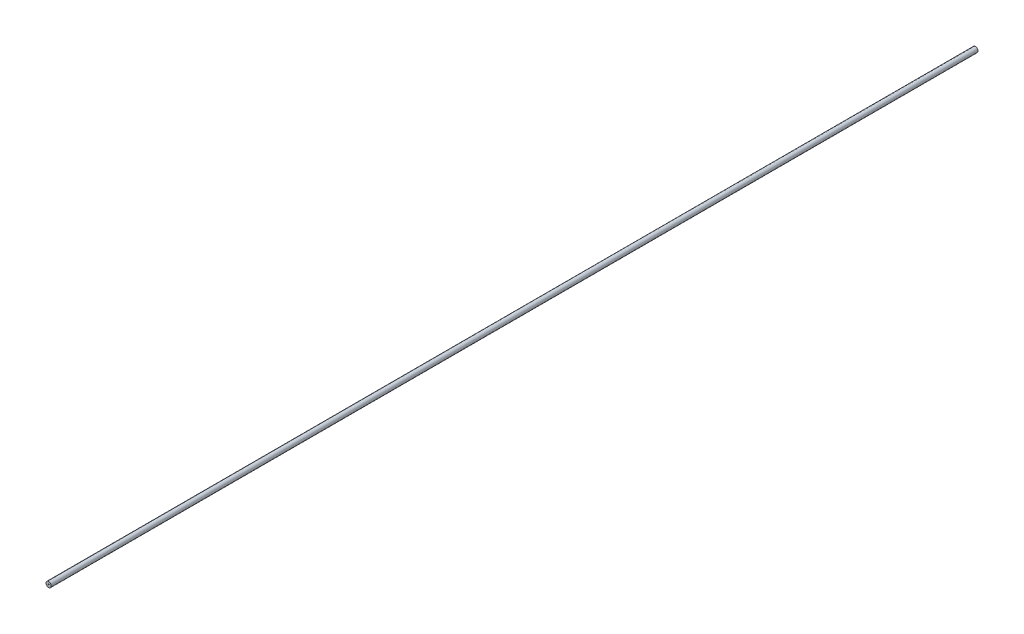
ISO-10303-21;
HEADER;
FILE_DESCRIPTION(('STEP AP214'),'2;1');
FILE_NAME('part.step','',(''),(''),'','','');
FILE_SCHEMA(('AUTOMOTIVE_DESIGN { 1 0 10303 214 1 1 1 1 }'));
ENDSEC;
DATA;
#1=APPLICATION_CONTEXT('core data for automotive mechanical design processes');
#2=APPLICATION_PROTOCOL_DEFINITION('international standard','automotive_design',2000,#1);
#3=PRODUCT_CONTEXT('',#1,'mechanical');
#4=PRODUCT('Part','Part','',(#3));
#5=PRODUCT_RELATED_PRODUCT_CATEGORY('part','',(#4));
#6=PRODUCT_DEFINITION_FORMATION('','',#4);
#7=PRODUCT_DEFINITION_CONTEXT('part definition',#1,'design');
#8=PRODUCT_DEFINITION('design','',#6,#7);
#9=PRODUCT_DEFINITION_SHAPE('','',#8);
#10=(LENGTH_UNIT() NAMED_UNIT(*) SI_UNIT(.MILLI.,.METRE.));
#11=(NAMED_UNIT(*) PLANE_ANGLE_UNIT() SI_UNIT($,.RADIAN.));
#12=(NAMED_UNIT(*) SI_UNIT($,.STERADIAN.) SOLID_ANGLE_UNIT());
#13=UNCERTAINTY_MEASURE_WITH_UNIT(LENGTH_MEASURE(1.E-05),#10,'distance_accuracy_value','');
#14=(GEOMETRIC_REPRESENTATION_CONTEXT(3) GLOBAL_UNCERTAINTY_ASSIGNED_CONTEXT((#13)) GLOBAL_UNIT_ASSIGNED_CONTEXT((#10,
#11,#12)) REPRESENTATION_CONTEXT('',''));
#15=CARTESIAN_POINT('',(0.,0.,0.));
#16=DIRECTION('',(0.,0.,1.));
#17=DIRECTION('',(1.,0.,0.));
#18=AXIS2_PLACEMENT_3D('',#15,#16,#17);
#19=CARTESIAN_POINT('',(0.,0.,-488.696070125041));
#20=DIRECTION('',(0.,0.,-1.));
#21=DIRECTION('',(1.,0.,0.));
#22=AXIS2_PLACEMENT_3D('',#19,#20,#21);
#23=PLANE('',#22);
#24=CARTESIAN_POINT('',(0.,0.,-488.696070125041));
#25=DIRECTION('',(0.,0.,1.));
#26=DIRECTION('',(1.,0.,0.));
#27=AXIS2_PLACEMENT_3D('',#24,#25,#26);
#28=CIRCLE('',#27,2.75);
#29=CARTESIAN_POINT('',(2.75,0.,-488.696070125041));
#30=VERTEX_POINT('',#29);
#31=EDGE_CURVE('E10',#30,#30,#28,.T.);
#32=ORIENTED_EDGE('',*,*,#31,.F.);
#33=EDGE_LOOP('',(#32));
#34=FACE_BOUND('',#33,.T.);
#35=CARTESIAN_POINT('',(0.,0.,-488.696070125041));
#36=DIRECTION('',(0.,0.,1.));
#37=DIRECTION('',(1.,0.,0.));
#38=AXIS2_PLACEMENT_3D('',#35,#36,#37);
#39=CIRCLE('',#38,0.5);
#40=CARTESIAN_POINT('',(0.5,0.,-488.696070125041));
#41=VERTEX_POINT('',#40);
#42=EDGE_CURVE('E46',#41,#41,#39,.T.);
#43=ORIENTED_EDGE('',*,*,#42,.T.);
#44=EDGE_LOOP('',(#43));
#45=FACE_BOUND('',#44,.T.);
#46=ADVANCED_FACE('F35',(#34,#45),#23,.T.);
#47=CARTESIAN_POINT('',(0.,0.,488.696070125041));
#48=DIRECTION('',(0.,0.,-1.));
#49=DIRECTION('',(1.,0.,0.));
#50=AXIS2_PLACEMENT_3D('',#47,#48,#49);
#51=PLANE('',#50);
#52=CARTESIAN_POINT('',(0.,0.,488.696070125041));
#53=DIRECTION('',(0.,0.,1.));
#54=DIRECTION('',(1.,0.,0.));
#55=AXIS2_PLACEMENT_3D('',#52,#53,#54);
#56=CIRCLE('',#55,2.75);
#57=CARTESIAN_POINT('',(2.75,0.,488.696070125041));
#58=VERTEX_POINT('',#57);
#59=EDGE_CURVE('E39',#58,#58,#56,.T.);
#60=ORIENTED_EDGE('',*,*,#59,.T.);
#61=EDGE_LOOP('',(#60));
#62=FACE_BOUND('',#61,.T.);
#63=CARTESIAN_POINT('',(0.,0.,488.696070125041));
#64=DIRECTION('',(0.,0.,1.));
#65=DIRECTION('',(1.,0.,0.));
#66=AXIS2_PLACEMENT_3D('',#63,#64,#65);
#67=CIRCLE('',#66,0.5);
#68=CARTESIAN_POINT('',(0.5,0.,488.696070125041));
#69=VERTEX_POINT('',#68);
#70=EDGE_CURVE('E48',#69,#69,#67,.T.);
#71=ORIENTED_EDGE('',*,*,#70,.F.);
#72=EDGE_LOOP('',(#71));
#73=FACE_BOUND('',#72,.T.);
#74=ADVANCED_FACE('F61',(#62,#73),#51,.F.);
#75=CARTESIAN_POINT('',(0.,0.,-488.696070125041));
#76=DIRECTION('',(0.,0.,1.));
#77=DIRECTION('',(-1.,0.,0.));
#78=AXIS2_PLACEMENT_3D('',#75,#76,#77);
#79=CYLINDRICAL_SURFACE('',#78,2.75);
#80=ORIENTED_EDGE('',*,*,#31,.T.);
#81=EDGE_LOOP('',(#80));
#82=FACE_BOUND('',#81,.T.);
#83=ORIENTED_EDGE('',*,*,#59,.F.);
#84=EDGE_LOOP('',(#83));
#85=FACE_BOUND('',#84,.T.);
#86=ADVANCED_FACE('F37',(#82,#85),#79,.T.);
#87=CARTESIAN_POINT('',(0.,0.,-488.696070125041));
#88=DIRECTION('',(0.,0.,1.));
#89=DIRECTION('',(-1.,0.,0.));
#90=AXIS2_PLACEMENT_3D('',#87,#88,#89);
#91=CYLINDRICAL_SURFACE('',#90,0.5);
#92=ORIENTED_EDGE('',*,*,#42,.F.);
#93=EDGE_LOOP('',(#92));
#94=FACE_BOUND('',#93,.T.);
#95=ORIENTED_EDGE('',*,*,#70,.T.);
#96=EDGE_LOOP('',(#95));
#97=FACE_BOUND('',#96,.T.);
#98=ADVANCED_FACE('F55',(#94,#97),#91,.F.);
#99=CLOSED_SHELL('',(#46,#74,#86,#98));
#100=MANIFOLD_SOLID_BREP('B2',#99);
#101=ADVANCED_BREP_SHAPE_REPRESENTATION('',(#18,#100),#14);
#102=SHAPE_DEFINITION_REPRESENTATION(#9,#101);
ENDSEC;
END-ISO-10303-21;
